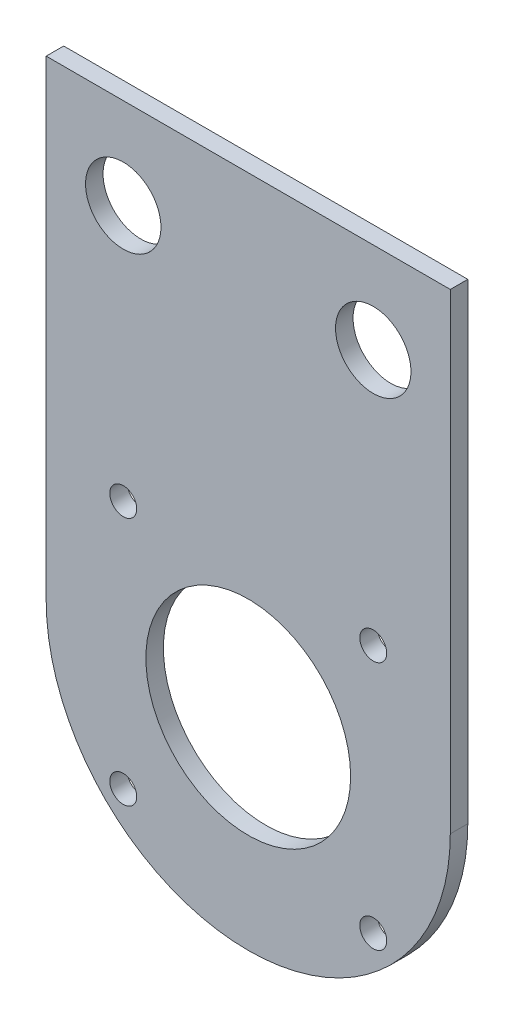
ISO-10303-21;
HEADER;
FILE_DESCRIPTION(('STEP AP214'),'2;1');
FILE_NAME('part.step','',(''),(''),'','','');
FILE_SCHEMA(('AUTOMOTIVE_DESIGN { 1 0 10303 214 1 1 1 1 }'));
ENDSEC;
DATA;
#1=APPLICATION_CONTEXT('core data for automotive mechanical design processes');
#2=APPLICATION_PROTOCOL_DEFINITION('international standard','automotive_design',2000,#1);
#3=PRODUCT_CONTEXT('',#1,'mechanical');
#4=PRODUCT('Part','Part','',(#3));
#5=PRODUCT_RELATED_PRODUCT_CATEGORY('part','',(#4));
#6=PRODUCT_DEFINITION_FORMATION('','',#4);
#7=PRODUCT_DEFINITION_CONTEXT('part definition',#1,'design');
#8=PRODUCT_DEFINITION('design','',#6,#7);
#9=PRODUCT_DEFINITION_SHAPE('','',#8);
#10=(LENGTH_UNIT() NAMED_UNIT(*) SI_UNIT(.MILLI.,.METRE.));
#11=(NAMED_UNIT(*) PLANE_ANGLE_UNIT() SI_UNIT($,.RADIAN.));
#12=(NAMED_UNIT(*) SI_UNIT($,.STERADIAN.) SOLID_ANGLE_UNIT());
#13=UNCERTAINTY_MEASURE_WITH_UNIT(LENGTH_MEASURE(1.E-05),#10,'distance_accuracy_value','');
#14=(GEOMETRIC_REPRESENTATION_CONTEXT(3) GLOBAL_UNCERTAINTY_ASSIGNED_CONTEXT((#13)) GLOBAL_UNIT_ASSIGNED_CONTEXT((#10,
#11,#12)) REPRESENTATION_CONTEXT('',''));
#15=CARTESIAN_POINT('',(0.,0.,0.));
#16=DIRECTION('',(0.,0.,1.));
#17=DIRECTION('',(1.,0.,0.));
#18=AXIS2_PLACEMENT_3D('',#15,#16,#17);
#19=CARTESIAN_POINT('',(0.,0.,3.302));
#20=DIRECTION('',(0.,0.,1.));
#21=DIRECTION('',(1.,0.,0.));
#22=AXIS2_PLACEMENT_3D('',#19,#20,#21);
#23=PLANE('',#22);
#24=CARTESIAN_POINT('',(-23.57,71.755,3.302));
#25=DIRECTION('',(0.,0.,1.));
#26=DIRECTION('',(1.,0.,0.));
#27=AXIS2_PLACEMENT_3D('',#24,#25,#26);
#28=CIRCLE('',#27,7.11199999999999);
#29=CARTESIAN_POINT('',(-16.458,71.755,3.302));
#30=VERTEX_POINT('',#29);
#31=EDGE_CURVE('E139',#30,#30,#28,.T.);
#32=ORIENTED_EDGE('',*,*,#31,.F.);
#33=EDGE_LOOP('',(#32));
#34=FACE_BOUND('',#33,.T.);
#35=CARTESIAN_POINT('',(-23.57,-23.495,3.302));
#36=DIRECTION('',(0.,0.,1.));
#37=DIRECTION('',(-1.,0.,0.));
#38=AXIS2_PLACEMENT_3D('',#35,#36,#37);
#39=CIRCLE('',#38,2.53999999999999);
#40=CARTESIAN_POINT('',(-26.11,-23.495,3.302));
#41=VERTEX_POINT('',#40);
#42=EDGE_CURVE('E127',#41,#41,#39,.T.);
#43=ORIENTED_EDGE('',*,*,#42,.F.);
#44=EDGE_LOOP('',(#43));
#45=FACE_BOUND('',#44,.T.);
#46=CARTESIAN_POINT('',(23.57,23.495,3.302));
#47=DIRECTION('',(0.,0.,1.));
#48=DIRECTION('',(-1.,0.,0.));
#49=AXIS2_PLACEMENT_3D('',#46,#47,#48);
#50=CIRCLE('',#49,2.53999999999999);
#51=CARTESIAN_POINT('',(21.03,23.495,3.302));
#52=VERTEX_POINT('',#51);
#53=EDGE_CURVE('E115',#52,#52,#50,.T.);
#54=ORIENTED_EDGE('',*,*,#53,.F.);
#55=EDGE_LOOP('',(#54));
#56=FACE_BOUND('',#55,.T.);
#57=CARTESIAN_POINT('',(0.,0.,3.302));
#58=DIRECTION('',(0.,0.,1.));
#59=DIRECTION('',(1.,0.,0.));
#60=AXIS2_PLACEMENT_3D('',#57,#58,#59);
#61=CIRCLE('',#60,38.1);
#62=CARTESIAN_POINT('',(-38.1,0.,3.302));
#63=VERTEX_POINT('',#62);
#64=CARTESIAN_POINT('',(38.1,0.,3.302));
#65=VERTEX_POINT('',#64);
#66=EDGE_CURVE('E85',#63,#65,#61,.T.);
#67=ORIENTED_EDGE('',*,*,#66,.T.);
#68=DIRECTION('',(0.,1.,0.));
#69=VECTOR('',#68,1.);
#70=CARTESIAN_POINT('',(38.1,0.,3.302));
#71=LINE('',#70,#69);
#72=CARTESIAN_POINT('',(38.1,88.9,3.302));
#73=VERTEX_POINT('',#72);
#74=EDGE_CURVE('E80',#65,#73,#71,.T.);
#75=ORIENTED_EDGE('',*,*,#74,.T.);
#76=DIRECTION('',(-1.,0.,0.));
#77=VECTOR('',#76,1.);
#78=CARTESIAN_POINT('',(-38.1,88.9,3.302));
#79=LINE('',#78,#77);
#80=CARTESIAN_POINT('',(-38.1,88.9,3.302));
#81=VERTEX_POINT('',#80);
#82=EDGE_CURVE('E83',#73,#81,#79,.T.);
#83=ORIENTED_EDGE('',*,*,#82,.T.);
#84=DIRECTION('',(0.,-1.,0.));
#85=VECTOR('',#84,1.);
#86=CARTESIAN_POINT('',(-38.1,0.,3.302));
#87=LINE('',#86,#85);
#88=EDGE_CURVE('E50',#81,#63,#87,.T.);
#89=ORIENTED_EDGE('',*,*,#88,.T.);
#90=EDGE_LOOP('',(#67,#75,#83,#89));
#91=FACE_BOUND('',#90,.T.);
#92=CARTESIAN_POINT('',(23.57,71.755,3.302));
#93=DIRECTION('',(0.,0.,1.));
#94=DIRECTION('',(-1.,0.,0.));
#95=AXIS2_PLACEMENT_3D('',#92,#93,#94);
#96=CIRCLE('',#95,7.11199999999999);
#97=CARTESIAN_POINT('',(16.458,71.755,3.302));
#98=VERTEX_POINT('',#97);
#99=EDGE_CURVE('E100',#98,#98,#96,.T.);
#100=ORIENTED_EDGE('',*,*,#99,.F.);
#101=EDGE_LOOP('',(#100));
#102=FACE_BOUND('',#101,.T.);
#103=CARTESIAN_POINT('',(23.57,-23.495,3.302));
#104=DIRECTION('',(0.,0.,1.));
#105=DIRECTION('',(1.,0.,0.));
#106=AXIS2_PLACEMENT_3D('',#103,#104,#105);
#107=CIRCLE('',#106,2.53999999999999);
#108=CARTESIAN_POINT('',(26.11,-23.495,3.302));
#109=VERTEX_POINT('',#108);
#110=EDGE_CURVE('E121',#109,#109,#107,.T.);
#111=ORIENTED_EDGE('',*,*,#110,.F.);
#112=EDGE_LOOP('',(#111));
#113=FACE_BOUND('',#112,.T.);
#114=CARTESIAN_POINT('',(-23.57,23.495,3.302));
#115=DIRECTION('',(0.,0.,1.));
#116=DIRECTION('',(1.,0.,0.));
#117=AXIS2_PLACEMENT_3D('',#114,#115,#116);
#118=CIRCLE('',#117,2.53999999999999);
#119=CARTESIAN_POINT('',(-21.03,23.495,3.302));
#120=VERTEX_POINT('',#119);
#121=EDGE_CURVE('E133',#120,#120,#118,.T.);
#122=ORIENTED_EDGE('',*,*,#121,.F.);
#123=EDGE_LOOP('',(#122));
#124=FACE_BOUND('',#123,.T.);
#125=CARTESIAN_POINT('',(0.,0.,3.302));
#126=DIRECTION('',(0.,0.,1.));
#127=DIRECTION('',(1.,0.,0.));
#128=AXIS2_PLACEMENT_3D('',#125,#126,#127);
#129=CIRCLE('',#128,19.304);
#130=CARTESIAN_POINT('',(19.304,0.,3.302));
#131=VERTEX_POINT('',#130);
#132=EDGE_CURVE('E145',#131,#131,#129,.T.);
#133=ORIENTED_EDGE('',*,*,#132,.F.);
#134=EDGE_LOOP('',(#133));
#135=FACE_BOUND('',#134,.T.);
#136=ADVANCED_FACE('F33',(#34,#45,#56,#91,#102,#113,#124,#135),#23,.T.);
#137=CARTESIAN_POINT('',(0.,0.,0.));
#138=DIRECTION('',(0.,0.,1.));
#139=DIRECTION('',(1.,0.,0.));
#140=AXIS2_PLACEMENT_3D('',#137,#138,#139);
#141=PLANE('',#140);
#142=CARTESIAN_POINT('',(-23.57,71.755,0.));
#143=DIRECTION('',(0.,0.,1.));
#144=DIRECTION('',(1.,0.,0.));
#145=AXIS2_PLACEMENT_3D('',#142,#143,#144);
#146=CIRCLE('',#145,7.11199999999999);
#147=CARTESIAN_POINT('',(-16.458,71.755,0.));
#148=VERTEX_POINT('',#147);
#149=EDGE_CURVE('E142',#148,#148,#146,.T.);
#150=ORIENTED_EDGE('',*,*,#149,.T.);
#151=EDGE_LOOP('',(#150));
#152=FACE_BOUND('',#151,.T.);
#153=CARTESIAN_POINT('',(-23.57,-23.495,0.));
#154=DIRECTION('',(0.,0.,1.));
#155=DIRECTION('',(-1.,0.,0.));
#156=AXIS2_PLACEMENT_3D('',#153,#154,#155);
#157=CIRCLE('',#156,2.53999999999999);
#158=CARTESIAN_POINT('',(-26.11,-23.495,0.));
#159=VERTEX_POINT('',#158);
#160=EDGE_CURVE('E130',#159,#159,#157,.T.);
#161=ORIENTED_EDGE('',*,*,#160,.T.);
#162=EDGE_LOOP('',(#161));
#163=FACE_BOUND('',#162,.T.);
#164=CARTESIAN_POINT('',(23.57,23.495,0.));
#165=DIRECTION('',(0.,0.,1.));
#166=DIRECTION('',(-1.,0.,0.));
#167=AXIS2_PLACEMENT_3D('',#164,#165,#166);
#168=CIRCLE('',#167,2.53999999999999);
#169=CARTESIAN_POINT('',(21.03,23.495,0.));
#170=VERTEX_POINT('',#169);
#171=EDGE_CURVE('E118',#170,#170,#168,.T.);
#172=ORIENTED_EDGE('',*,*,#171,.T.);
#173=EDGE_LOOP('',(#172));
#174=FACE_BOUND('',#173,.T.);
#175=CARTESIAN_POINT('',(0.,0.,0.));
#176=DIRECTION('',(0.,0.,1.));
#177=DIRECTION('',(1.,0.,0.));
#178=AXIS2_PLACEMENT_3D('',#175,#176,#177);
#179=CIRCLE('',#178,38.1);
#180=CARTESIAN_POINT('',(-38.1,0.,0.));
#181=VERTEX_POINT('',#180);
#182=CARTESIAN_POINT('',(38.1,0.,0.));
#183=VERTEX_POINT('',#182);
#184=EDGE_CURVE('E97',#181,#183,#179,.T.);
#185=ORIENTED_EDGE('',*,*,#184,.F.);
#186=DIRECTION('',(0.,-1.,0.));
#187=VECTOR('',#186,1.);
#188=CARTESIAN_POINT('',(-38.1,0.,0.));
#189=LINE('',#188,#187);
#190=CARTESIAN_POINT('',(-38.1,88.9,0.));
#191=VERTEX_POINT('',#190);
#192=EDGE_CURVE('E73',#191,#181,#189,.T.);
#193=ORIENTED_EDGE('',*,*,#192,.F.);
#194=DIRECTION('',(-1.,0.,0.));
#195=VECTOR('',#194,1.);
#196=CARTESIAN_POINT('',(-38.1,88.9,0.));
#197=LINE('',#196,#195);
#198=CARTESIAN_POINT('',(38.1,88.9,0.));
#199=VERTEX_POINT('',#198);
#200=EDGE_CURVE('E67',#199,#191,#197,.T.);
#201=ORIENTED_EDGE('',*,*,#200,.F.);
#202=DIRECTION('',(0.,1.,0.));
#203=VECTOR('',#202,1.);
#204=CARTESIAN_POINT('',(38.1,0.,0.));
#205=LINE('',#204,#203);
#206=EDGE_CURVE('E89',#183,#199,#205,.T.);
#207=ORIENTED_EDGE('',*,*,#206,.F.);
#208=EDGE_LOOP('',(#185,#193,#201,#207));
#209=FACE_BOUND('',#208,.T.);
#210=CARTESIAN_POINT('',(23.57,71.755,0.));
#211=DIRECTION('',(0.,0.,1.));
#212=DIRECTION('',(-1.,0.,0.));
#213=AXIS2_PLACEMENT_3D('',#210,#211,#212);
#214=CIRCLE('',#213,7.11199999999999);
#215=CARTESIAN_POINT('',(16.458,71.755,0.));
#216=VERTEX_POINT('',#215);
#217=EDGE_CURVE('E112',#216,#216,#214,.T.);
#218=ORIENTED_EDGE('',*,*,#217,.T.);
#219=EDGE_LOOP('',(#218));
#220=FACE_BOUND('',#219,.T.);
#221=CARTESIAN_POINT('',(23.57,-23.495,0.));
#222=DIRECTION('',(0.,0.,1.));
#223=DIRECTION('',(1.,0.,0.));
#224=AXIS2_PLACEMENT_3D('',#221,#222,#223);
#225=CIRCLE('',#224,2.53999999999999);
#226=CARTESIAN_POINT('',(26.11,-23.495,0.));
#227=VERTEX_POINT('',#226);
#228=EDGE_CURVE('E124',#227,#227,#225,.T.);
#229=ORIENTED_EDGE('',*,*,#228,.T.);
#230=EDGE_LOOP('',(#229));
#231=FACE_BOUND('',#230,.T.);
#232=CARTESIAN_POINT('',(-23.57,23.495,0.));
#233=DIRECTION('',(0.,0.,1.));
#234=DIRECTION('',(1.,0.,0.));
#235=AXIS2_PLACEMENT_3D('',#232,#233,#234);
#236=CIRCLE('',#235,2.53999999999999);
#237=CARTESIAN_POINT('',(-21.03,23.495,0.));
#238=VERTEX_POINT('',#237);
#239=EDGE_CURVE('E136',#238,#238,#236,.T.);
#240=ORIENTED_EDGE('',*,*,#239,.T.);
#241=EDGE_LOOP('',(#240));
#242=FACE_BOUND('',#241,.T.);
#243=CARTESIAN_POINT('',(0.,0.,0.));
#244=DIRECTION('',(0.,0.,1.));
#245=DIRECTION('',(1.,0.,0.));
#246=AXIS2_PLACEMENT_3D('',#243,#244,#245);
#247=CIRCLE('',#246,19.304);
#248=CARTESIAN_POINT('',(19.304,0.,0.));
#249=VERTEX_POINT('',#248);
#250=EDGE_CURVE('E148',#249,#249,#247,.T.);
#251=ORIENTED_EDGE('',*,*,#250,.T.);
#252=EDGE_LOOP('',(#251));
#253=FACE_BOUND('',#252,.T.);
#254=ADVANCED_FACE('F108',(#152,#163,#174,#209,#220,#231,#242,#253),#141,.F.);
#255=CARTESIAN_POINT('',(0.,0.,3.302));
#256=DIRECTION('',(0.,0.,-1.));
#257=DIRECTION('',(-1.,0.,0.));
#258=AXIS2_PLACEMENT_3D('',#255,#256,#257);
#259=CYLINDRICAL_SURFACE('',#258,38.1);
#260=ORIENTED_EDGE('',*,*,#184,.T.);
#261=DIRECTION('',(0.,0.,-1.));
#262=VECTOR('',#261,1.);
#263=CARTESIAN_POINT('',(38.1,0.,3.302));
#264=LINE('',#263,#262);
#265=EDGE_CURVE('E11',#65,#183,#264,.T.);
#266=ORIENTED_EDGE('',*,*,#265,.F.);
#267=ORIENTED_EDGE('',*,*,#66,.F.);
#268=DIRECTION('',(0.,0.,-1.));
#269=VECTOR('',#268,1.);
#270=CARTESIAN_POINT('',(-38.1,0.,3.302));
#271=LINE('',#270,#269);
#272=EDGE_CURVE('E93',#63,#181,#271,.T.);
#273=ORIENTED_EDGE('',*,*,#272,.T.);
#274=EDGE_LOOP('',(#260,#266,#267,#273));
#275=FACE_BOUND('',#274,.T.);
#276=ADVANCED_FACE('F35',(#275),#259,.T.);
#277=CARTESIAN_POINT('',(38.1,0.,3.302));
#278=DIRECTION('',(-1.,0.,0.));
#279=DIRECTION('',(0.,0.,1.));
#280=AXIS2_PLACEMENT_3D('',#277,#278,#279);
#281=PLANE('',#280);
#282=ORIENTED_EDGE('',*,*,#206,.T.);
#283=DIRECTION('',(0.,0.,-1.));
#284=VECTOR('',#283,1.);
#285=CARTESIAN_POINT('',(38.1,88.9,3.302));
#286=LINE('',#285,#284);
#287=EDGE_CURVE('E42',#73,#199,#286,.T.);
#288=ORIENTED_EDGE('',*,*,#287,.F.);
#289=ORIENTED_EDGE('',*,*,#74,.F.);
#290=ORIENTED_EDGE('',*,*,#265,.T.);
#291=EDGE_LOOP('',(#282,#288,#289,#290));
#292=FACE_BOUND('',#291,.T.);
#293=ADVANCED_FACE('F88',(#292),#281,.F.);
#294=CARTESIAN_POINT('',(-38.1,88.9,3.302));
#295=DIRECTION('',(0.,-1.,0.));
#296=DIRECTION('',(0.,0.,-1.));
#297=AXIS2_PLACEMENT_3D('',#294,#295,#296);
#298=PLANE('',#297);
#299=ORIENTED_EDGE('',*,*,#200,.T.);
#300=DIRECTION('',(0.,0.,-1.));
#301=VECTOR('',#300,1.);
#302=CARTESIAN_POINT('',(-38.1,88.9,3.302));
#303=LINE('',#302,#301);
#304=EDGE_CURVE('E90',#81,#191,#303,.T.);
#305=ORIENTED_EDGE('',*,*,#304,.F.);
#306=ORIENTED_EDGE('',*,*,#82,.F.);
#307=ORIENTED_EDGE('',*,*,#287,.T.);
#308=EDGE_LOOP('',(#299,#305,#306,#307));
#309=FACE_BOUND('',#308,.T.);
#310=ADVANCED_FACE('F91',(#309),#298,.F.);
#311=CARTESIAN_POINT('',(-38.1,0.,3.302));
#312=DIRECTION('',(1.,0.,0.));
#313=DIRECTION('',(0.,0.,-1.));
#314=AXIS2_PLACEMENT_3D('',#311,#312,#313);
#315=PLANE('',#314);
#316=ORIENTED_EDGE('',*,*,#192,.T.);
#317=ORIENTED_EDGE('',*,*,#272,.F.);
#318=ORIENTED_EDGE('',*,*,#88,.F.);
#319=ORIENTED_EDGE('',*,*,#304,.T.);
#320=EDGE_LOOP('',(#316,#317,#318,#319));
#321=FACE_BOUND('',#320,.T.);
#322=ADVANCED_FACE('F105',(#321),#315,.F.);
#323=CARTESIAN_POINT('',(23.57,71.755,3.302));
#324=DIRECTION('',(0.,0.,-1.));
#325=DIRECTION('',(-1.,0.,0.));
#326=AXIS2_PLACEMENT_3D('',#323,#324,#325);
#327=CYLINDRICAL_SURFACE('',#326,7.11199999999999);
#328=ORIENTED_EDGE('',*,*,#99,.T.);
#329=EDGE_LOOP('',(#328));
#330=FACE_BOUND('',#329,.T.);
#331=ORIENTED_EDGE('',*,*,#217,.F.);
#332=EDGE_LOOP('',(#331));
#333=FACE_BOUND('',#332,.T.);
#334=ADVANCED_FACE('F168',(#330,#333),#327,.F.);
#335=CARTESIAN_POINT('',(23.57,23.495,3.302));
#336=DIRECTION('',(0.,0.,-1.));
#337=DIRECTION('',(-1.,0.,0.));
#338=AXIS2_PLACEMENT_3D('',#335,#336,#337);
#339=CYLINDRICAL_SURFACE('',#338,2.53999999999999);
#340=ORIENTED_EDGE('',*,*,#53,.T.);
#341=EDGE_LOOP('',(#340));
#342=FACE_BOUND('',#341,.T.);
#343=ORIENTED_EDGE('',*,*,#171,.F.);
#344=EDGE_LOOP('',(#343));
#345=FACE_BOUND('',#344,.T.);
#346=ADVANCED_FACE('F214',(#342,#345),#339,.F.);
#347=CARTESIAN_POINT('',(23.57,-23.495,3.302));
#348=DIRECTION('',(0.,0.,-1.));
#349=DIRECTION('',(-1.,0.,0.));
#350=AXIS2_PLACEMENT_3D('',#347,#348,#349);
#351=CYLINDRICAL_SURFACE('',#350,2.53999999999999);
#352=ORIENTED_EDGE('',*,*,#110,.T.);
#353=EDGE_LOOP('',(#352));
#354=FACE_BOUND('',#353,.T.);
#355=ORIENTED_EDGE('',*,*,#228,.F.);
#356=EDGE_LOOP('',(#355));
#357=FACE_BOUND('',#356,.T.);
#358=ADVANCED_FACE('F222',(#354,#357),#351,.F.);
#359=CARTESIAN_POINT('',(-23.57,-23.495,3.302));
#360=DIRECTION('',(0.,0.,-1.));
#361=DIRECTION('',(-1.,0.,0.));
#362=AXIS2_PLACEMENT_3D('',#359,#360,#361);
#363=CYLINDRICAL_SURFACE('',#362,2.53999999999999);
#364=ORIENTED_EDGE('',*,*,#42,.T.);
#365=EDGE_LOOP('',(#364));
#366=FACE_BOUND('',#365,.T.);
#367=ORIENTED_EDGE('',*,*,#160,.F.);
#368=EDGE_LOOP('',(#367));
#369=FACE_BOUND('',#368,.T.);
#370=ADVANCED_FACE('F230',(#366,#369),#363,.F.);
#371=CARTESIAN_POINT('',(-23.57,23.495,3.302));
#372=DIRECTION('',(0.,0.,-1.));
#373=DIRECTION('',(-1.,0.,0.));
#374=AXIS2_PLACEMENT_3D('',#371,#372,#373);
#375=CYLINDRICAL_SURFACE('',#374,2.53999999999999);
#376=ORIENTED_EDGE('',*,*,#121,.T.);
#377=EDGE_LOOP('',(#376));
#378=FACE_BOUND('',#377,.T.);
#379=ORIENTED_EDGE('',*,*,#239,.F.);
#380=EDGE_LOOP('',(#379));
#381=FACE_BOUND('',#380,.T.);
#382=ADVANCED_FACE('F239',(#378,#381),#375,.F.);
#383=CARTESIAN_POINT('',(-23.57,71.755,3.302));
#384=DIRECTION('',(0.,0.,-1.));
#385=DIRECTION('',(-1.,0.,0.));
#386=AXIS2_PLACEMENT_3D('',#383,#384,#385);
#387=CYLINDRICAL_SURFACE('',#386,7.11199999999999);
#388=ORIENTED_EDGE('',*,*,#31,.T.);
#389=EDGE_LOOP('',(#388));
#390=FACE_BOUND('',#389,.T.);
#391=ORIENTED_EDGE('',*,*,#149,.F.);
#392=EDGE_LOOP('',(#391));
#393=FACE_BOUND('',#392,.T.);
#394=ADVANCED_FACE('F248',(#390,#393),#387,.F.);
#395=CARTESIAN_POINT('',(0.,0.,3.302));
#396=DIRECTION('',(0.,0.,-1.));
#397=DIRECTION('',(-1.,0.,0.));
#398=AXIS2_PLACEMENT_3D('',#395,#396,#397);
#399=CYLINDRICAL_SURFACE('',#398,19.304);
#400=ORIENTED_EDGE('',*,*,#132,.T.);
#401=EDGE_LOOP('',(#400));
#402=FACE_BOUND('',#401,.T.);
#403=ORIENTED_EDGE('',*,*,#250,.F.);
#404=EDGE_LOOP('',(#403));
#405=FACE_BOUND('',#404,.T.);
#406=ADVANCED_FACE('F154',(#402,#405),#399,.F.);
#407=CLOSED_SHELL('',(#136,#254,#276,#293,#310,#322,#334,#346,#358,#370,#382,#394,#406));
#408=MANIFOLD_SOLID_BREP('B2',#407);
#409=ADVANCED_BREP_SHAPE_REPRESENTATION('',(#18,#408),#14);
#410=SHAPE_DEFINITION_REPRESENTATION(#9,#409);
ENDSEC;
END-ISO-10303-21;
